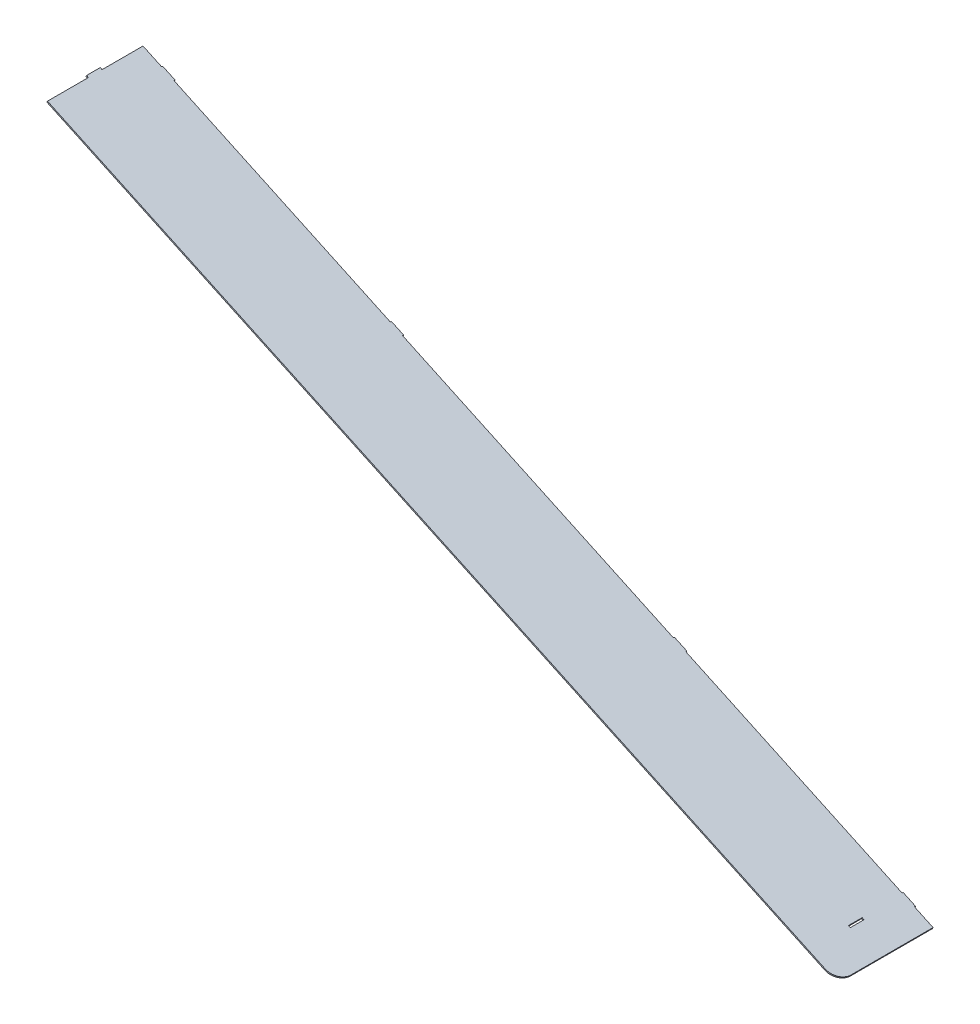
ISO-10303-21;
HEADER;
FILE_DESCRIPTION(('STEP AP214'),'2;1');
FILE_NAME('part.step','',(''),(''),'','','');
FILE_SCHEMA(('AUTOMOTIVE_DESIGN { 1 0 10303 214 1 1 1 1 }'));
ENDSEC;
DATA;
#1=APPLICATION_CONTEXT('core data for automotive mechanical design processes');
#2=APPLICATION_PROTOCOL_DEFINITION('international standard','automotive_design',2000,#1);
#3=PRODUCT_CONTEXT('',#1,'mechanical');
#4=PRODUCT('Part','Part','',(#3));
#5=PRODUCT_RELATED_PRODUCT_CATEGORY('part','',(#4));
#6=PRODUCT_DEFINITION_FORMATION('','',#4);
#7=PRODUCT_DEFINITION_CONTEXT('part definition',#1,'design');
#8=PRODUCT_DEFINITION('design','',#6,#7);
#9=PRODUCT_DEFINITION_SHAPE('','',#8);
#10=(LENGTH_UNIT() NAMED_UNIT(*) SI_UNIT(.MILLI.,.METRE.));
#11=(NAMED_UNIT(*) PLANE_ANGLE_UNIT() SI_UNIT($,.RADIAN.));
#12=(NAMED_UNIT(*) SI_UNIT($,.STERADIAN.) SOLID_ANGLE_UNIT());
#13=UNCERTAINTY_MEASURE_WITH_UNIT(LENGTH_MEASURE(1.E-05),#10,'distance_accuracy_value','');
#14=(GEOMETRIC_REPRESENTATION_CONTEXT(3) GLOBAL_UNCERTAINTY_ASSIGNED_CONTEXT((#13)) GLOBAL_UNIT_ASSIGNED_CONTEXT((#10,
#11,#12)) REPRESENTATION_CONTEXT('',''));
#15=CARTESIAN_POINT('',(0.,0.,0.));
#16=DIRECTION('',(0.,0.,1.));
#17=DIRECTION('',(1.,0.,0.));
#18=AXIS2_PLACEMENT_3D('',#15,#16,#17);
#19=CARTESIAN_POINT('',(2.22044604925031E-13,612.726283004898,142.));
#20=DIRECTION('',(-0.90630778703665,0.422618261740698,0.));
#21=DIRECTION('',(-0.422618261740699,-0.906307787036651,0.));
#22=AXIS2_PLACEMENT_3D('',#19,#20,#21);
#23=PLANE('',#22);
#24=DIRECTION('',(0.,0.,-1.));
#25=VECTOR('',#24,1.);
#26=CARTESIAN_POINT('',(2.22044604925031E-13,612.726283004898,142.));
#27=LINE('',#26,#25);
#28=CARTESIAN_POINT('',(2.22044604925031E-13,612.726283004898,62.));
#29=VERTEX_POINT('',#28);
#30=CARTESIAN_POINT('',(2.22044604925031E-13,612.726283004898,2.));
#31=VERTEX_POINT('',#30);
#32=EDGE_CURVE('E409',#29,#31,#27,.T.);
#33=ORIENTED_EDGE('',*,*,#32,.F.);
#34=DIRECTION('',(0.422618261740699,0.90630778703665,0.));
#35=VECTOR('',#34,1.);
#36=CARTESIAN_POINT('',(2.22044604925031E-13,612.726283004898,62.));
#37=LINE('',#36,#35);
#38=CARTESIAN_POINT('',(0.845236523481674,614.538898578972,62.));
#39=VERTEX_POINT('',#38);
#40=EDGE_CURVE('E272',#29,#39,#37,.T.);
#41=ORIENTED_EDGE('',*,*,#40,.T.);
#42=DIRECTION('',(0.,0.,-1.));
#43=VECTOR('',#42,1.);
#44=CARTESIAN_POINT('',(0.845236523481674,614.538898578972,142.));
#45=LINE('',#44,#43);
#46=CARTESIAN_POINT('',(0.845236523481674,614.538898578972,2.));
#47=VERTEX_POINT('',#46);
#48=EDGE_CURVE('E427',#39,#47,#45,.T.);
#49=ORIENTED_EDGE('',*,*,#48,.T.);
#50=DIRECTION('',(0.422618261740698,0.90630778703665,0.));
#51=VECTOR('',#50,1.);
#52=CARTESIAN_POINT('',(2.22044604925031E-13,612.726283004898,2.));
#53=LINE('',#52,#51);
#54=EDGE_CURVE('E403',#31,#47,#53,.T.);
#55=ORIENTED_EDGE('',*,*,#54,.F.);
#56=EDGE_LOOP('',(#33,#41,#49,#55));
#57=FACE_BOUND('',#56,.T.);
#58=ADVANCED_FACE('F36',(#57),#23,.T.);
#59=CARTESIAN_POINT('',(0.,0.,2.));
#60=DIRECTION('',(0.,0.,-1.));
#61=DIRECTION('',(-1.,0.,0.));
#62=AXIS2_PLACEMENT_3D('',#59,#60,#61);
#63=PLANE('',#62);
#64=DIRECTION('',(0.422618261740699,0.90630778703665,0.));
#65=VECTOR('',#64,1.);
#66=CARTESIAN_POINT('',(1112.83937412469,93.8007605541419,2.));
#67=LINE('',#66,#65);
#68=CARTESIAN_POINT('',(1112.83937412469,93.8007605541415,2.));
#69=VERTEX_POINT('',#68);
#70=CARTESIAN_POINT('',(1113.68461064817,95.6133761282152,2.));
#71=VERTEX_POINT('',#70);
#72=EDGE_CURVE('E299',#69,#71,#67,.T.);
#73=ORIENTED_EDGE('',*,*,#72,.F.);
#74=DIRECTION('',(0.90630778703665,-0.4226182617407,0.));
#75=VECTOR('',#74,1.);
#76=CARTESIAN_POINT('',(2.22044604925031E-13,612.726283004898,2.));
#77=LINE('',#76,#75);
#78=CARTESIAN_POINT('',(795.631648661858,241.717152163387,2.));
#79=VERTEX_POINT('',#78);
#80=EDGE_CURVE('E461',#79,#69,#77,.T.);
#81=ORIENTED_EDGE('',*,*,#80,.F.);
#82=DIRECTION('',(0.422618261740699,0.90630778703665,0.));
#83=VECTOR('',#82,1.);
#84=CARTESIAN_POINT('',(795.631648661858,241.717152163387,2.));
#85=LINE('',#84,#83);
#86=CARTESIAN_POINT('',(796.47688518534,243.52976773746,2.));
#87=VERTEX_POINT('',#86);
#88=EDGE_CURVE('E340',#79,#87,#85,.T.);
#89=ORIENTED_EDGE('',*,*,#88,.T.);
#90=DIRECTION('',(0.90630778703665,-0.4226182617407,0.));
#91=VECTOR('',#90,1.);
#92=CARTESIAN_POINT('',(0.845236523481674,614.538898578972,2.));
#93=LINE('',#92,#91);
#94=EDGE_CURVE('E502',#87,#71,#93,.T.);
#95=ORIENTED_EDGE('',*,*,#94,.T.);
#96=EDGE_LOOP('',(#73,#81,#89,#95));
#97=FACE_BOUND('',#96,.T.);
#98=ADVANCED_FACE('F501',(#97),#63,.T.);
#99=DIRECTION('',(0.422618261740699,0.90630778703665,0.));
#100=VECTOR('',#99,1.);
#101=CARTESIAN_POINT('',(777.505492921125,250.169517398201,2.));
#102=LINE('',#101,#100);
#103=CARTESIAN_POINT('',(777.505492921125,250.169517398201,2.));
#104=VERTEX_POINT('',#103);
#105=CARTESIAN_POINT('',(778.350729444607,251.982132972274,2.));
#106=VERTEX_POINT('',#105);
#107=EDGE_CURVE('E327',#104,#106,#102,.T.);
#108=ORIENTED_EDGE('',*,*,#107,.F.);
#109=CARTESIAN_POINT('',(380.649270555393,435.226613073805,2.));
#110=VERTEX_POINT('',#109);
#111=EDGE_CURVE('E463',#110,#104,#77,.T.);
#112=ORIENTED_EDGE('',*,*,#111,.F.);
#113=DIRECTION('',(0.422618261740699,0.90630778703665,0.));
#114=VECTOR('',#113,1.);
#115=CARTESIAN_POINT('',(380.649270555393,435.226613073805,2.));
#116=LINE('',#115,#114);
#117=CARTESIAN_POINT('',(381.494507078875,437.039228647878,2.));
#118=VERTEX_POINT('',#117);
#119=EDGE_CURVE('E368',#110,#118,#116,.T.);
#120=ORIENTED_EDGE('',*,*,#119,.T.);
#121=EDGE_CURVE('E488',#118,#106,#93,.T.);
#122=ORIENTED_EDGE('',*,*,#121,.T.);
#123=EDGE_LOOP('',(#108,#112,#120,#122));
#124=FACE_BOUND('',#123,.T.);
#125=ADVANCED_FACE('F487',(#124),#63,.T.);
#126=DIRECTION('',(0.422618261740699,0.90630778703665,0.));
#127=VECTOR('',#126,1.);
#128=CARTESIAN_POINT('',(362.52311481466,443.678978308619,2.));
#129=LINE('',#128,#127);
#130=CARTESIAN_POINT('',(362.52311481466,443.678978308619,2.));
#131=VERTEX_POINT('',#130);
#132=CARTESIAN_POINT('',(363.368351338141,445.491593882692,2.));
#133=VERTEX_POINT('',#132);
#134=EDGE_CURVE('E355',#131,#133,#129,.T.);
#135=ORIENTED_EDGE('',*,*,#134,.F.);
#136=CARTESIAN_POINT('',(45.3153893518327,591.595369917863,2.));
#137=VERTEX_POINT('',#136);
#138=EDGE_CURVE('E414',#137,#131,#77,.T.);
#139=ORIENTED_EDGE('',*,*,#138,.F.);
#140=DIRECTION('',(0.422618261740699,0.90630778703665,0.));
#141=VECTOR('',#140,1.);
#142=CARTESIAN_POINT('',(45.3153893518327,591.595369917863,2.));
#143=LINE('',#142,#141);
#144=CARTESIAN_POINT('',(46.1606258753141,593.407985491937,2.));
#145=VERTEX_POINT('',#144);
#146=EDGE_CURVE('E395',#137,#145,#143,.T.);
#147=ORIENTED_EDGE('',*,*,#146,.T.);
#148=EDGE_CURVE('E421',#145,#133,#93,.T.);
#149=ORIENTED_EDGE('',*,*,#148,.T.);
#150=EDGE_LOOP('',(#135,#139,#147,#149));
#151=FACE_BOUND('',#150,.T.);
#152=ADVANCED_FACE('F514',(#151),#63,.T.);
#153=DIRECTION('',(0.422618261740699,0.90630778703665,0.));
#154=VECTOR('',#153,1.);
#155=CARTESIAN_POINT('',(1130.96552986542,85.3483953193279,2.));
#156=LINE('',#155,#154);
#157=CARTESIAN_POINT('',(1130.96552986542,85.3483953193278,2.));
#158=VERTEX_POINT('',#157);
#159=CARTESIAN_POINT('',(1131.8107663889,87.1610108934012,2.));
#160=VERTEX_POINT('',#159);
#161=EDGE_CURVE('E312',#158,#160,#156,.T.);
#162=ORIENTED_EDGE('',*,*,#161,.T.);
#163=CARTESIAN_POINT('',(1159.,74.48246304118,2.));
#164=VERTEX_POINT('',#163);
#165=EDGE_CURVE('E417',#160,#164,#93,.T.);
#166=ORIENTED_EDGE('',*,*,#165,.T.);
#167=DIRECTION('',(-0.42261826174072,-0.90630778703664,0.));
#168=VECTOR('',#167,1.);
#169=CARTESIAN_POINT('',(1159.,74.48246304118,2.));
#170=LINE('',#169,#168);
#171=CARTESIAN_POINT('',(1158.15476347652,72.6698474671067,2.));
#172=VERTEX_POINT('',#171);
#173=EDGE_CURVE('E413',#164,#172,#170,.T.);
#174=ORIENTED_EDGE('',*,*,#173,.T.);
#175=EDGE_CURVE('E392',#158,#172,#77,.T.);
#176=ORIENTED_EDGE('',*,*,#175,.F.);
#177=EDGE_LOOP('',(#162,#166,#174,#176));
#178=FACE_BOUND('',#177,.T.);
#179=ADVANCED_FACE('F512',(#178),#63,.T.);
#180=CARTESIAN_POINT('',(2.22044604925031E-13,612.726283004898,142.));
#181=DIRECTION('',(0.4226182617407,0.90630778703665,0.));
#182=DIRECTION('',(-0.90630778703665,0.4226182617407,0.));
#183=AXIS2_PLACEMENT_3D('',#180,#181,#182);
#184=PLANE('',#183);
#185=DIRECTION('',(0.906307787036651,-0.422618261740698,0.));
#186=VECTOR('',#185,1.);
#187=CARTESIAN_POINT('',(1116.84573741881,91.932562668742,82.1));
#188=LINE('',#187,#186);
#189=CARTESIAN_POINT('',(1114.1268140577,93.2004174539641,82.1));
#190=VERTEX_POINT('',#189);
#191=CARTESIAN_POINT('',(1116.84573741881,91.932562668742,82.1));
#192=VERTEX_POINT('',#191);
#193=EDGE_CURVE('E234',#190,#192,#188,.T.);
#194=ORIENTED_EDGE('',*,*,#193,.T.);
#195=DIRECTION('',(0.,0.,-1.));
#196=VECTOR('',#195,1.);
#197=CARTESIAN_POINT('',(1116.84573741881,91.932562668742,61.9));
#198=LINE('',#197,#196);
#199=CARTESIAN_POINT('',(1116.84573741881,91.932562668742,61.9));
#200=VERTEX_POINT('',#199);
#201=EDGE_CURVE('E228',#192,#200,#198,.T.);
#202=ORIENTED_EDGE('',*,*,#201,.T.);
#203=DIRECTION('',(-0.906307787036651,0.422618261740698,0.));
#204=VECTOR('',#203,1.);
#205=CARTESIAN_POINT('',(1116.84573741881,91.932562668742,61.9));
#206=LINE('',#205,#204);
#207=CARTESIAN_POINT('',(1114.1268140577,93.2004174539638,61.9));
#208=VERTEX_POINT('',#207);
#209=EDGE_CURVE('E237',#200,#208,#206,.T.);
#210=ORIENTED_EDGE('',*,*,#209,.T.);
#211=DIRECTION('',(0.,0.,1.));
#212=VECTOR('',#211,1.);
#213=CARTESIAN_POINT('',(1114.1268140577,93.2004174539641,61.9));
#214=LINE('',#213,#212);
#215=EDGE_CURVE('E51',#208,#190,#214,.T.);
#216=ORIENTED_EDGE('',*,*,#215,.T.);
#217=EDGE_LOOP('',(#194,#202,#210,#216));
#218=FACE_BOUND('',#217,.T.);
#219=DIRECTION('',(0.,0.,-1.));
#220=VECTOR('',#219,1.);
#221=CARTESIAN_POINT('',(1158.15476347652,72.6698474671067,142.));
#222=LINE('',#221,#220);
#223=CARTESIAN_POINT('',(1158.15476347652,72.6698474671067,122.));
#224=VERTEX_POINT('',#223);
#225=EDGE_CURVE('E434',#224,#172,#222,.T.);
#226=ORIENTED_EDGE('',*,*,#225,.F.);
#227=CARTESIAN_POINT('',(1140.02860773579,81.1222127019207,122.));
#228=DIRECTION('',(0.4226182617407,0.90630778703665,0.));
#229=DIRECTION('',(-0.90630778703665,0.4226182617407,0.));
#230=AXIS2_PLACEMENT_3D('',#227,#228,#229);
#231=CIRCLE('',#230,20.);
#232=CARTESIAN_POINT('',(1140.02860773579,81.1222127019207,142.));
#233=VERTEX_POINT('',#232);
#234=EDGE_CURVE('E440',#224,#233,#231,.F.);
#235=ORIENTED_EDGE('',*,*,#234,.T.);
#236=DIRECTION('',(0.90630778703665,-0.4226182617407,0.));
#237=VECTOR('',#236,1.);
#238=CARTESIAN_POINT('',(2.22044604925031E-13,612.726283004898,142.));
#239=LINE('',#238,#237);
#240=CARTESIAN_POINT('',(2.22044604925031E-13,612.726283004898,142.));
#241=VERTEX_POINT('',#240);
#242=EDGE_CURVE('E399',#241,#233,#239,.T.);
#243=ORIENTED_EDGE('',*,*,#242,.F.);
#244=CARTESIAN_POINT('',(2.22044604925031E-13,612.726283004898,82.));
#245=VERTEX_POINT('',#244);
#246=EDGE_CURVE('E424',#241,#245,#27,.T.);
#247=ORIENTED_EDGE('',*,*,#246,.T.);
#248=DIRECTION('',(0.906307787036653,-0.422618261740693,0.));
#249=VECTOR('',#248,1.);
#250=CARTESIAN_POINT('',(2.22044604925031E-13,612.726283004898,82.));
#251=LINE('',#250,#249);
#252=CARTESIAN_POINT('',(-2.71892336110968,613.99413779012,82.));
#253=VERTEX_POINT('',#252);
#254=EDGE_CURVE('E270',#253,#245,#251,.T.);
#255=ORIENTED_EDGE('',*,*,#254,.F.);
#256=DIRECTION('',(0.,0.,1.));
#257=VECTOR('',#256,1.);
#258=CARTESIAN_POINT('',(-2.71892336110968,613.99413779012,82.));
#259=LINE('',#258,#257);
#260=CARTESIAN_POINT('',(-2.71892336110968,613.99413779012,62.));
#261=VERTEX_POINT('',#260);
#262=EDGE_CURVE('E266',#261,#253,#259,.T.);
#263=ORIENTED_EDGE('',*,*,#262,.F.);
#264=DIRECTION('',(-0.906307787036653,0.422618261740693,0.));
#265=VECTOR('',#264,1.);
#266=CARTESIAN_POINT('',(2.22044604925031E-13,612.726283004898,62.));
#267=LINE('',#266,#265);
#268=EDGE_CURVE('E263',#29,#261,#267,.T.);
#269=ORIENTED_EDGE('',*,*,#268,.F.);
#270=ORIENTED_EDGE('',*,*,#32,.T.);
#271=CARTESIAN_POINT('',(27.1892336110997,600.047735152677,2.));
#272=VERTEX_POINT('',#271);
#273=EDGE_CURVE('E410',#31,#272,#77,.T.);
#274=ORIENTED_EDGE('',*,*,#273,.T.);
#275=DIRECTION('',(0.,0.,1.));
#276=VECTOR('',#275,1.);
#277=CARTESIAN_POINT('',(27.1892336110997,600.047735152677,2.));
#278=LINE('',#277,#276);
#279=CARTESIAN_POINT('',(27.1892336110997,600.047735152677,0.5));
#280=VERTEX_POINT('',#279);
#281=EDGE_CURVE('E373',#280,#272,#278,.T.);
#282=ORIENTED_EDGE('',*,*,#281,.F.);
#283=DIRECTION('',(-0.90630778703665,0.422618261740698,0.));
#284=VECTOR('',#283,1.);
#285=CARTESIAN_POINT('',(27.1892336110997,600.047735152677,0.5));
#286=LINE('',#285,#284);
#287=CARTESIAN_POINT('',(45.3153893518327,591.595369917863,0.5));
#288=VERTEX_POINT('',#287);
#289=EDGE_CURVE('E379',#288,#280,#286,.T.);
#290=ORIENTED_EDGE('',*,*,#289,.F.);
#291=DIRECTION('',(0.,0.,-1.));
#292=VECTOR('',#291,1.);
#293=CARTESIAN_POINT('',(45.3153893518327,591.595369917863,2.));
#294=LINE('',#293,#292);
#295=EDGE_CURVE('E375',#137,#288,#294,.T.);
#296=ORIENTED_EDGE('',*,*,#295,.F.);
#297=ORIENTED_EDGE('',*,*,#138,.T.);
#298=DIRECTION('',(0.,0.,1.));
#299=VECTOR('',#298,1.);
#300=CARTESIAN_POINT('',(362.52311481466,443.678978308619,2.));
#301=LINE('',#300,#299);
#302=CARTESIAN_POINT('',(362.52311481466,443.678978308619,0.5));
#303=VERTEX_POINT('',#302);
#304=EDGE_CURVE('E345',#303,#131,#301,.T.);
#305=ORIENTED_EDGE('',*,*,#304,.F.);
#306=DIRECTION('',(-0.90630778703665,0.422618261740699,0.));
#307=VECTOR('',#306,1.);
#308=CARTESIAN_POINT('',(362.52311481466,443.678978308619,0.5));
#309=LINE('',#308,#307);
#310=CARTESIAN_POINT('',(380.649270555393,435.226613073805,0.5));
#311=VERTEX_POINT('',#310);
#312=EDGE_CURVE('E352',#311,#303,#309,.T.);
#313=ORIENTED_EDGE('',*,*,#312,.F.);
#314=DIRECTION('',(0.,0.,-1.));
#315=VECTOR('',#314,1.);
#316=CARTESIAN_POINT('',(380.649270555393,435.226613073805,2.));
#317=LINE('',#316,#315);
#318=EDGE_CURVE('E348',#110,#311,#317,.T.);
#319=ORIENTED_EDGE('',*,*,#318,.F.);
#320=ORIENTED_EDGE('',*,*,#111,.T.);
#321=DIRECTION('',(0.,0.,1.));
#322=VECTOR('',#321,1.);
#323=CARTESIAN_POINT('',(777.505492921125,250.169517398201,2.));
#324=LINE('',#323,#322);
#325=CARTESIAN_POINT('',(777.505492921125,250.169517398201,0.5));
#326=VERTEX_POINT('',#325);
#327=EDGE_CURVE('E317',#326,#104,#324,.T.);
#328=ORIENTED_EDGE('',*,*,#327,.F.);
#329=DIRECTION('',(-0.906307787036651,0.422618261740697,0.));
#330=VECTOR('',#329,1.);
#331=CARTESIAN_POINT('',(777.505492921125,250.169517398201,0.5));
#332=LINE('',#331,#330);
#333=CARTESIAN_POINT('',(795.631648661858,241.717152163387,0.5));
#334=VERTEX_POINT('',#333);
#335=EDGE_CURVE('E324',#334,#326,#332,.T.);
#336=ORIENTED_EDGE('',*,*,#335,.F.);
#337=DIRECTION('',(0.,0.,-1.));
#338=VECTOR('',#337,1.);
#339=CARTESIAN_POINT('',(795.631648661858,241.717152163387,2.));
#340=LINE('',#339,#338);
#341=EDGE_CURVE('E320',#79,#334,#340,.T.);
#342=ORIENTED_EDGE('',*,*,#341,.F.);
#343=ORIENTED_EDGE('',*,*,#80,.T.);
#344=DIRECTION('',(0.,0.,1.));
#345=VECTOR('',#344,1.);
#346=CARTESIAN_POINT('',(1112.83937412469,93.8007605541419,2.));
#347=LINE('',#346,#345);
#348=CARTESIAN_POINT('',(1112.83937412469,93.8007605541419,0.5));
#349=VERTEX_POINT('',#348);
#350=EDGE_CURVE('E289',#349,#69,#347,.T.);
#351=ORIENTED_EDGE('',*,*,#350,.F.);
#352=DIRECTION('',(-0.906307787036648,0.422618261740704,0.));
#353=VECTOR('',#352,1.);
#354=CARTESIAN_POINT('',(1112.83937412469,93.8007605541419,0.5));
#355=LINE('',#354,#353);
#356=CARTESIAN_POINT('',(1130.96552986542,85.3483953193279,0.5));
#357=VERTEX_POINT('',#356);
#358=EDGE_CURVE('E296',#357,#349,#355,.T.);
#359=ORIENTED_EDGE('',*,*,#358,.F.);
#360=DIRECTION('',(0.,0.,-1.));
#361=VECTOR('',#360,1.);
#362=CARTESIAN_POINT('',(1130.96552986542,85.3483953193279,2.));
#363=LINE('',#362,#361);
#364=EDGE_CURVE('E292',#158,#357,#363,.T.);
#365=ORIENTED_EDGE('',*,*,#364,.F.);
#366=ORIENTED_EDGE('',*,*,#175,.T.);
#367=EDGE_LOOP('',(#226,#235,#243,#247,#255,#263,#269,#270,#274,#282,#290,#296,#297,#305,#313,
#319,#320,#328,#336,#342,#343,#351,#359,#365,#366));
#368=FACE_BOUND('',#367,.T.);
#369=ADVANCED_FACE('F241',(#218,#368),#184,.F.);
#370=CARTESIAN_POINT('',(1159.,74.48246304118,142.));
#371=DIRECTION('',(0.90630778703664,-0.42261826174072,0.));
#372=DIRECTION('',(0.42261826174072,0.90630778703664,0.));
#373=AXIS2_PLACEMENT_3D('',#370,#371,#372);
#374=PLANE('',#373);
#375=DIRECTION('',(0.,0.,-1.));
#376=VECTOR('',#375,1.);
#377=CARTESIAN_POINT('',(1159.,74.48246304118,142.));
#378=LINE('',#377,#376);
#379=CARTESIAN_POINT('',(1159.,74.48246304118,122.));
#380=VERTEX_POINT('',#379);
#381=EDGE_CURVE('E431',#380,#164,#378,.T.);
#382=ORIENTED_EDGE('',*,*,#381,.F.);
#383=DIRECTION('',(-0.42261826174072,-0.90630778703664,0.));
#384=VECTOR('',#383,1.);
#385=CARTESIAN_POINT('',(1158.15476347652,72.6698474671067,122.));
#386=LINE('',#385,#384);
#387=EDGE_CURVE('E437',#380,#224,#386,.T.);
#388=ORIENTED_EDGE('',*,*,#387,.T.);
#389=ORIENTED_EDGE('',*,*,#225,.T.);
#390=ORIENTED_EDGE('',*,*,#173,.F.);
#391=EDGE_LOOP('',(#382,#388,#389,#390));
#392=FACE_BOUND('',#391,.T.);
#393=ADVANCED_FACE('F455',(#392),#374,.T.);
#394=CARTESIAN_POINT('',(0.845236523481674,614.538898578972,142.));
#395=DIRECTION('',(0.4226182617407,0.90630778703665,0.));
#396=DIRECTION('',(-0.90630778703665,0.4226182617407,0.));
#397=AXIS2_PLACEMENT_3D('',#394,#395,#396);
#398=PLANE('',#397);
#399=DIRECTION('',(0.,0.,-1.));
#400=VECTOR('',#399,1.);
#401=CARTESIAN_POINT('',(1117.69097394229,93.7451782428153,61.9));
#402=LINE('',#401,#400);
#403=CARTESIAN_POINT('',(1117.69097394229,93.7451782428153,82.1));
#404=VERTEX_POINT('',#403);
#405=CARTESIAN_POINT('',(1117.69097394229,93.7451782428151,61.9));
#406=VERTEX_POINT('',#405);
#407=EDGE_CURVE('E59',#404,#406,#402,.T.);
#408=ORIENTED_EDGE('',*,*,#407,.F.);
#409=DIRECTION('',(0.906307787036651,-0.422618261740698,0.));
#410=VECTOR('',#409,1.);
#411=CARTESIAN_POINT('',(1117.69097394229,93.7451782428153,82.1));
#412=LINE('',#411,#410);
#413=CARTESIAN_POINT('',(1114.97205058118,95.0130330280374,82.1));
#414=VERTEX_POINT('',#413);
#415=EDGE_CURVE('E244',#414,#404,#412,.T.);
#416=ORIENTED_EDGE('',*,*,#415,.F.);
#417=DIRECTION('',(0.,0.,1.));
#418=VECTOR('',#417,1.);
#419=CARTESIAN_POINT('',(1114.97205058118,95.0130330280374,61.9));
#420=LINE('',#419,#418);
#421=CARTESIAN_POINT('',(1114.97205058118,95.0130330280374,61.9));
#422=VERTEX_POINT('',#421);
#423=EDGE_CURVE('E247',#422,#414,#420,.T.);
#424=ORIENTED_EDGE('',*,*,#423,.F.);
#425=DIRECTION('',(-0.906307787036651,0.422618261740698,0.));
#426=VECTOR('',#425,1.);
#427=CARTESIAN_POINT('',(1117.69097394229,93.7451782428153,61.9));
#428=LINE('',#427,#426);
#429=EDGE_CURVE('E253',#406,#422,#428,.T.);
#430=ORIENTED_EDGE('',*,*,#429,.F.);
#431=EDGE_LOOP('',(#408,#416,#424,#430));
#432=FACE_BOUND('',#431,.T.);
#433=DIRECTION('',(0.90630778703665,-0.4226182617407,0.));
#434=VECTOR('',#433,1.);
#435=CARTESIAN_POINT('',(0.845236523481674,614.538898578972,142.));
#436=LINE('',#435,#434);
#437=CARTESIAN_POINT('',(0.845236523481674,614.538898578972,142.));
#438=VERTEX_POINT('',#437);
#439=CARTESIAN_POINT('',(1140.87384425927,82.934828275994,142.));
#440=VERTEX_POINT('',#439);
#441=EDGE_CURVE('E402',#438,#440,#436,.T.);
#442=ORIENTED_EDGE('',*,*,#441,.T.);
#443=CARTESIAN_POINT('',(1140.87384425927,82.934828275994,122.));
#444=DIRECTION('',(0.4226182617407,0.90630778703665,0.));
#445=DIRECTION('',(-0.90630778703665,0.4226182617407,0.));
#446=AXIS2_PLACEMENT_3D('',#443,#444,#445);
#447=CIRCLE('',#446,20.);
#448=EDGE_CURVE('E11',#440,#380,#447,.T.);
#449=ORIENTED_EDGE('',*,*,#448,.T.);
#450=ORIENTED_EDGE('',*,*,#381,.T.);
#451=ORIENTED_EDGE('',*,*,#165,.F.);
#452=DIRECTION('',(0.,0.,-1.));
#453=VECTOR('',#452,1.);
#454=CARTESIAN_POINT('',(1131.8107663889,87.1610108934012,2.));
#455=LINE('',#454,#453);
#456=CARTESIAN_POINT('',(1131.8107663889,87.1610108934012,0.5));
#457=VERTEX_POINT('',#456);
#458=EDGE_CURVE('E302',#160,#457,#455,.T.);
#459=ORIENTED_EDGE('',*,*,#458,.T.);
#460=DIRECTION('',(-0.906307787036648,0.422618261740704,0.));
#461=VECTOR('',#460,1.);
#462=CARTESIAN_POINT('',(1113.68461064817,95.6133761282153,0.5));
#463=LINE('',#462,#461);
#464=CARTESIAN_POINT('',(1113.68461064817,95.6133761282153,0.5));
#465=VERTEX_POINT('',#464);
#466=EDGE_CURVE('E293',#457,#465,#463,.T.);
#467=ORIENTED_EDGE('',*,*,#466,.T.);
#468=DIRECTION('',(0.,0.,1.));
#469=VECTOR('',#468,1.);
#470=CARTESIAN_POINT('',(1113.68461064817,95.6133761282153,2.));
#471=LINE('',#470,#469);
#472=EDGE_CURVE('E282',#465,#71,#471,.T.);
#473=ORIENTED_EDGE('',*,*,#472,.T.);
#474=ORIENTED_EDGE('',*,*,#94,.F.);
#475=DIRECTION('',(0.,0.,-1.));
#476=VECTOR('',#475,1.);
#477=CARTESIAN_POINT('',(796.47688518534,243.52976773746,2.));
#478=LINE('',#477,#476);
#479=CARTESIAN_POINT('',(796.47688518534,243.52976773746,0.5));
#480=VERTEX_POINT('',#479);
#481=EDGE_CURVE('E330',#87,#480,#478,.T.);
#482=ORIENTED_EDGE('',*,*,#481,.T.);
#483=DIRECTION('',(-0.906307787036651,0.422618261740697,0.));
#484=VECTOR('',#483,1.);
#485=CARTESIAN_POINT('',(778.350729444607,251.982132972274,0.5));
#486=LINE('',#485,#484);
#487=CARTESIAN_POINT('',(778.350729444607,251.982132972274,0.5));
#488=VERTEX_POINT('',#487);
#489=EDGE_CURVE('E321',#480,#488,#486,.T.);
#490=ORIENTED_EDGE('',*,*,#489,.T.);
#491=DIRECTION('',(0.,0.,1.));
#492=VECTOR('',#491,1.);
#493=CARTESIAN_POINT('',(778.350729444607,251.982132972274,2.));
#494=LINE('',#493,#492);
#495=EDGE_CURVE('E309',#488,#106,#494,.T.);
#496=ORIENTED_EDGE('',*,*,#495,.T.);
#497=ORIENTED_EDGE('',*,*,#121,.F.);
#498=DIRECTION('',(0.,0.,-1.));
#499=VECTOR('',#498,1.);
#500=CARTESIAN_POINT('',(381.494507078875,437.039228647878,2.));
#501=LINE('',#500,#499);
#502=CARTESIAN_POINT('',(381.494507078875,437.039228647878,0.5));
#503=VERTEX_POINT('',#502);
#504=EDGE_CURVE('E358',#118,#503,#501,.T.);
#505=ORIENTED_EDGE('',*,*,#504,.T.);
#506=DIRECTION('',(-0.90630778703665,0.422618261740699,0.));
#507=VECTOR('',#506,1.);
#508=CARTESIAN_POINT('',(363.368351338142,445.491593882692,0.5));
#509=LINE('',#508,#507);
#510=CARTESIAN_POINT('',(363.368351338142,445.491593882692,0.5));
#511=VERTEX_POINT('',#510);
#512=EDGE_CURVE('E349',#503,#511,#509,.T.);
#513=ORIENTED_EDGE('',*,*,#512,.T.);
#514=DIRECTION('',(0.,0.,1.));
#515=VECTOR('',#514,1.);
#516=CARTESIAN_POINT('',(363.368351338142,445.491593882692,2.));
#517=LINE('',#516,#515);
#518=EDGE_CURVE('E337',#511,#133,#517,.T.);
#519=ORIENTED_EDGE('',*,*,#518,.T.);
#520=ORIENTED_EDGE('',*,*,#148,.F.);
#521=DIRECTION('',(0.,0.,-1.));
#522=VECTOR('',#521,1.);
#523=CARTESIAN_POINT('',(46.1606258753141,593.407985491937,2.));
#524=LINE('',#523,#522);
#525=CARTESIAN_POINT('',(46.1606258753141,593.407985491937,0.5));
#526=VERTEX_POINT('',#525);
#527=EDGE_CURVE('E385',#145,#526,#524,.T.);
#528=ORIENTED_EDGE('',*,*,#527,.T.);
#529=DIRECTION('',(-0.90630778703665,0.422618261740698,0.));
#530=VECTOR('',#529,1.);
#531=CARTESIAN_POINT('',(28.034470134581,601.860350726751,0.5));
#532=LINE('',#531,#530);
#533=CARTESIAN_POINT('',(28.034470134581,601.860350726751,0.5));
#534=VERTEX_POINT('',#533);
#535=EDGE_CURVE('E376',#526,#534,#532,.T.);
#536=ORIENTED_EDGE('',*,*,#535,.T.);
#537=DIRECTION('',(0.,0.,1.));
#538=VECTOR('',#537,1.);
#539=CARTESIAN_POINT('',(28.034470134581,601.860350726751,2.));
#540=LINE('',#539,#538);
#541=CARTESIAN_POINT('',(28.034470134581,601.860350726751,2.));
#542=VERTEX_POINT('',#541);
#543=EDGE_CURVE('E365',#534,#542,#540,.T.);
#544=ORIENTED_EDGE('',*,*,#543,.T.);
#545=EDGE_CURVE('E418',#47,#542,#93,.T.);
#546=ORIENTED_EDGE('',*,*,#545,.F.);
#547=ORIENTED_EDGE('',*,*,#48,.F.);
#548=DIRECTION('',(-0.906307787036653,0.422618261740693,0.));
#549=VECTOR('',#548,1.);
#550=CARTESIAN_POINT('',(0.845236523481674,614.538898578972,62.));
#551=LINE('',#550,#549);
#552=CARTESIAN_POINT('',(-1.87368683762834,615.806753364194,62.));
#553=VERTEX_POINT('',#552);
#554=EDGE_CURVE('E259',#39,#553,#551,.T.);
#555=ORIENTED_EDGE('',*,*,#554,.T.);
#556=DIRECTION('',(0.,0.,1.));
#557=VECTOR('',#556,1.);
#558=CARTESIAN_POINT('',(-1.87368683762834,615.806753364194,82.));
#559=LINE('',#558,#557);
#560=CARTESIAN_POINT('',(-1.87368683762834,615.806753364194,82.));
#561=VERTEX_POINT('',#560);
#562=EDGE_CURVE('E275',#553,#561,#559,.T.);
#563=ORIENTED_EDGE('',*,*,#562,.T.);
#564=DIRECTION('',(0.906307787036653,-0.422618261740693,0.));
#565=VECTOR('',#564,1.);
#566=CARTESIAN_POINT('',(0.845236523481674,614.538898578972,82.));
#567=LINE('',#566,#565);
#568=CARTESIAN_POINT('',(0.845236523481674,614.538898578972,82.));
#569=VERTEX_POINT('',#568);
#570=EDGE_CURVE('E267',#561,#569,#567,.T.);
#571=ORIENTED_EDGE('',*,*,#570,.T.);
#572=EDGE_CURVE('E428',#438,#569,#45,.T.);
#573=ORIENTED_EDGE('',*,*,#572,.F.);
#574=EDGE_LOOP('',(#442,#449,#450,#451,#459,#467,#473,#474,#482,#490,#496,#497,#505,#513,#519,
#520,#528,#536,#544,#546,#547,#555,#563,#571,#573));
#575=FACE_BOUND('',#574,.T.);
#576=ADVANCED_FACE('F450',(#432,#575),#398,.T.);
#577=DIRECTION('',(0.422618261740699,0.90630778703665,0.));
#578=VECTOR('',#577,1.);
#579=CARTESIAN_POINT('',(2.22044604925031E-13,612.726283004898,82.));
#580=LINE('',#579,#578);
#581=EDGE_CURVE('E280',#245,#569,#580,.T.);
#582=ORIENTED_EDGE('',*,*,#581,.F.);
#583=ORIENTED_EDGE('',*,*,#246,.F.);
#584=DIRECTION('',(0.422618261740698,0.90630778703665,0.));
#585=VECTOR('',#584,1.);
#586=CARTESIAN_POINT('',(2.22044604925031E-13,612.726283004898,142.));
#587=LINE('',#586,#585);
#588=EDGE_CURVE('E406',#241,#438,#587,.T.);
#589=ORIENTED_EDGE('',*,*,#588,.T.);
#590=ORIENTED_EDGE('',*,*,#572,.T.);
#591=EDGE_LOOP('',(#582,#583,#589,#590));
#592=FACE_BOUND('',#591,.T.);
#593=ADVANCED_FACE('F545',(#592),#23,.T.);
#594=CARTESIAN_POINT('',(0.,0.,142.));
#595=DIRECTION('',(0.,0.,-1.));
#596=DIRECTION('',(-1.,0.,0.));
#597=AXIS2_PLACEMENT_3D('',#594,#595,#596);
#598=PLANE('',#597);
#599=ORIENTED_EDGE('',*,*,#242,.T.);
#600=DIRECTION('',(-0.42261826174072,-0.90630778703664,0.));
#601=VECTOR('',#600,1.);
#602=CARTESIAN_POINT('',(1140.87384425927,82.9348282759944,142.));
#603=LINE('',#602,#601);
#604=EDGE_CURVE('E44',#233,#440,#603,.F.);
#605=ORIENTED_EDGE('',*,*,#604,.T.);
#606=ORIENTED_EDGE('',*,*,#441,.F.);
#607=ORIENTED_EDGE('',*,*,#588,.F.);
#608=EDGE_LOOP('',(#599,#605,#606,#607));
#609=FACE_BOUND('',#608,.T.);
#610=ADVANCED_FACE('F444',(#609),#598,.F.);
#611=DIRECTION('',(0.422618261740699,0.90630778703665,0.));
#612=VECTOR('',#611,1.);
#613=CARTESIAN_POINT('',(27.1892336110997,600.047735152677,2.));
#614=LINE('',#613,#612);
#615=EDGE_CURVE('E382',#272,#542,#614,.T.);
#616=ORIENTED_EDGE('',*,*,#615,.F.);
#617=ORIENTED_EDGE('',*,*,#273,.F.);
#618=ORIENTED_EDGE('',*,*,#54,.T.);
#619=ORIENTED_EDGE('',*,*,#545,.T.);
#620=EDGE_LOOP('',(#616,#617,#618,#619));
#621=FACE_BOUND('',#620,.T.);
#622=ADVANCED_FACE('F527',(#621),#63,.T.);
#623=CARTESIAN_POINT('',(1140.87384425927,82.9348282759944,122.));
#624=DIRECTION('',(0.42261826174072,0.90630778703664,0.));
#625=DIRECTION('',(-0.90630778703664,0.42261826174072,0.));
#626=AXIS2_PLACEMENT_3D('',#623,#624,#625);
#627=CYLINDRICAL_SURFACE('',#626,20.);
#628=ORIENTED_EDGE('',*,*,#448,.F.);
#629=ORIENTED_EDGE('',*,*,#604,.F.);
#630=ORIENTED_EDGE('',*,*,#234,.F.);
#631=ORIENTED_EDGE('',*,*,#387,.F.);
#632=EDGE_LOOP('',(#628,#629,#630,#631));
#633=FACE_BOUND('',#632,.T.);
#634=ADVANCED_FACE('F38',(#633),#627,.T.);
#635=CARTESIAN_POINT('',(27.1892336110997,600.047735152677,2.));
#636=DIRECTION('',(-0.90630778703665,0.422618261740699,0.));
#637=DIRECTION('',(-0.422618261740699,-0.90630778703665,0.));
#638=AXIS2_PLACEMENT_3D('',#635,#636,#637);
#639=PLANE('',#638);
#640=ORIENTED_EDGE('',*,*,#543,.F.);
#641=DIRECTION('',(0.422618261740699,0.90630778703665,0.));
#642=VECTOR('',#641,1.);
#643=CARTESIAN_POINT('',(27.1892336110997,600.047735152677,0.5));
#644=LINE('',#643,#642);
#645=EDGE_CURVE('E390',#280,#534,#644,.T.);
#646=ORIENTED_EDGE('',*,*,#645,.F.);
#647=ORIENTED_EDGE('',*,*,#281,.T.);
#648=ORIENTED_EDGE('',*,*,#615,.T.);
#649=EDGE_LOOP('',(#640,#646,#647,#648));
#650=FACE_BOUND('',#649,.T.);
#651=ADVANCED_FACE('F522',(#650),#639,.T.);
#652=CARTESIAN_POINT('',(27.1892336110997,600.047735152677,0.5));
#653=DIRECTION('',(0.,0.,-1.));
#654=DIRECTION('',(-1.,0.,0.));
#655=AXIS2_PLACEMENT_3D('',#652,#653,#654);
#656=PLANE('',#655);
#657=ORIENTED_EDGE('',*,*,#535,.F.);
#658=DIRECTION('',(0.422618261740699,0.90630778703665,0.));
#659=VECTOR('',#658,1.);
#660=CARTESIAN_POINT('',(45.3153893518327,591.595369917863,0.5));
#661=LINE('',#660,#659);
#662=EDGE_CURVE('E393',#288,#526,#661,.T.);
#663=ORIENTED_EDGE('',*,*,#662,.F.);
#664=ORIENTED_EDGE('',*,*,#289,.T.);
#665=ORIENTED_EDGE('',*,*,#645,.T.);
#666=EDGE_LOOP('',(#657,#663,#664,#665));
#667=FACE_BOUND('',#666,.T.);
#668=ADVANCED_FACE('F518',(#667),#656,.T.);
#669=CARTESIAN_POINT('',(45.3153893518327,591.595369917863,2.));
#670=DIRECTION('',(0.90630778703665,-0.422618261740699,0.));
#671=DIRECTION('',(0.422618261740699,0.90630778703665,0.));
#672=AXIS2_PLACEMENT_3D('',#669,#670,#671);
#673=PLANE('',#672);
#674=ORIENTED_EDGE('',*,*,#527,.F.);
#675=ORIENTED_EDGE('',*,*,#146,.F.);
#676=ORIENTED_EDGE('',*,*,#295,.T.);
#677=ORIENTED_EDGE('',*,*,#662,.T.);
#678=EDGE_LOOP('',(#674,#675,#676,#677));
#679=FACE_BOUND('',#678,.T.);
#680=ADVANCED_FACE('F688',(#679),#673,.T.);
#681=CARTESIAN_POINT('',(362.52311481466,443.678978308619,2.));
#682=DIRECTION('',(-0.90630778703665,0.422618261740699,0.));
#683=DIRECTION('',(-0.422618261740699,-0.90630778703665,0.));
#684=AXIS2_PLACEMENT_3D('',#681,#682,#683);
#685=PLANE('',#684);
#686=ORIENTED_EDGE('',*,*,#518,.F.);
#687=DIRECTION('',(0.422618261740699,0.90630778703665,0.));
#688=VECTOR('',#687,1.);
#689=CARTESIAN_POINT('',(362.52311481466,443.678978308619,0.5));
#690=LINE('',#689,#688);
#691=EDGE_CURVE('E363',#303,#511,#690,.T.);
#692=ORIENTED_EDGE('',*,*,#691,.F.);
#693=ORIENTED_EDGE('',*,*,#304,.T.);
#694=ORIENTED_EDGE('',*,*,#134,.T.);
#695=EDGE_LOOP('',(#686,#692,#693,#694));
#696=FACE_BOUND('',#695,.T.);
#697=ADVANCED_FACE('F478',(#696),#685,.T.);
#698=CARTESIAN_POINT('',(362.52311481466,443.678978308619,0.5));
#699=DIRECTION('',(0.,0.,-1.));
#700=DIRECTION('',(-1.,0.,0.));
#701=AXIS2_PLACEMENT_3D('',#698,#699,#700);
#702=PLANE('',#701);
#703=ORIENTED_EDGE('',*,*,#512,.F.);
#704=DIRECTION('',(0.422618261740699,0.90630778703665,0.));
#705=VECTOR('',#704,1.);
#706=CARTESIAN_POINT('',(380.649270555393,435.226613073805,0.5));
#707=LINE('',#706,#705);
#708=EDGE_CURVE('E366',#311,#503,#707,.T.);
#709=ORIENTED_EDGE('',*,*,#708,.F.);
#710=ORIENTED_EDGE('',*,*,#312,.T.);
#711=ORIENTED_EDGE('',*,*,#691,.T.);
#712=EDGE_LOOP('',(#703,#709,#710,#711));
#713=FACE_BOUND('',#712,.T.);
#714=ADVANCED_FACE('F481',(#713),#702,.T.);
#715=CARTESIAN_POINT('',(380.649270555393,435.226613073805,2.));
#716=DIRECTION('',(0.90630778703665,-0.422618261740699,0.));
#717=DIRECTION('',(0.422618261740699,0.90630778703665,0.));
#718=AXIS2_PLACEMENT_3D('',#715,#716,#717);
#719=PLANE('',#718);
#720=ORIENTED_EDGE('',*,*,#504,.F.);
#721=ORIENTED_EDGE('',*,*,#119,.F.);
#722=ORIENTED_EDGE('',*,*,#318,.T.);
#723=ORIENTED_EDGE('',*,*,#708,.T.);
#724=EDGE_LOOP('',(#720,#721,#722,#723));
#725=FACE_BOUND('',#724,.T.);
#726=ADVANCED_FACE('F485',(#725),#719,.T.);
#727=CARTESIAN_POINT('',(777.505492921125,250.169517398201,2.));
#728=DIRECTION('',(-0.90630778703665,0.422618261740699,0.));
#729=DIRECTION('',(-0.422618261740699,-0.90630778703665,0.));
#730=AXIS2_PLACEMENT_3D('',#727,#728,#729);
#731=PLANE('',#730);
#732=ORIENTED_EDGE('',*,*,#495,.F.);
#733=DIRECTION('',(0.422618261740699,0.90630778703665,0.));
#734=VECTOR('',#733,1.);
#735=CARTESIAN_POINT('',(777.505492921125,250.169517398201,0.5));
#736=LINE('',#735,#734);
#737=EDGE_CURVE('E335',#326,#488,#736,.T.);
#738=ORIENTED_EDGE('',*,*,#737,.F.);
#739=ORIENTED_EDGE('',*,*,#327,.T.);
#740=ORIENTED_EDGE('',*,*,#107,.T.);
#741=EDGE_LOOP('',(#732,#738,#739,#740));
#742=FACE_BOUND('',#741,.T.);
#743=ADVANCED_FACE('F491',(#742),#731,.T.);
#744=CARTESIAN_POINT('',(777.505492921125,250.169517398201,0.5));
#745=DIRECTION('',(0.,0.,-1.));
#746=DIRECTION('',(-1.,0.,0.));
#747=AXIS2_PLACEMENT_3D('',#744,#745,#746);
#748=PLANE('',#747);
#749=ORIENTED_EDGE('',*,*,#489,.F.);
#750=DIRECTION('',(0.422618261740699,0.90630778703665,0.));
#751=VECTOR('',#750,1.);
#752=CARTESIAN_POINT('',(795.631648661858,241.717152163387,0.5));
#753=LINE('',#752,#751);
#754=EDGE_CURVE('E338',#334,#480,#753,.T.);
#755=ORIENTED_EDGE('',*,*,#754,.F.);
#756=ORIENTED_EDGE('',*,*,#335,.T.);
#757=ORIENTED_EDGE('',*,*,#737,.T.);
#758=EDGE_LOOP('',(#749,#755,#756,#757));
#759=FACE_BOUND('',#758,.T.);
#760=ADVANCED_FACE('F495',(#759),#748,.T.);
#761=CARTESIAN_POINT('',(795.631648661858,241.717152163387,2.));
#762=DIRECTION('',(0.90630778703665,-0.422618261740699,0.));
#763=DIRECTION('',(0.422618261740699,0.90630778703665,0.));
#764=AXIS2_PLACEMENT_3D('',#761,#762,#763);
#765=PLANE('',#764);
#766=ORIENTED_EDGE('',*,*,#481,.F.);
#767=ORIENTED_EDGE('',*,*,#88,.F.);
#768=ORIENTED_EDGE('',*,*,#341,.T.);
#769=ORIENTED_EDGE('',*,*,#754,.T.);
#770=EDGE_LOOP('',(#766,#767,#768,#769));
#771=FACE_BOUND('',#770,.T.);
#772=ADVANCED_FACE('F499',(#771),#765,.T.);
#773=CARTESIAN_POINT('',(1112.83937412469,93.8007605541419,2.));
#774=DIRECTION('',(-0.90630778703665,0.422618261740699,0.));
#775=DIRECTION('',(-0.422618261740699,-0.90630778703665,0.));
#776=AXIS2_PLACEMENT_3D('',#773,#774,#775);
#777=PLANE('',#776);
#778=ORIENTED_EDGE('',*,*,#472,.F.);
#779=DIRECTION('',(0.422618261740699,0.90630778703665,0.));
#780=VECTOR('',#779,1.);
#781=CARTESIAN_POINT('',(1112.83937412469,93.8007605541419,0.5));
#782=LINE('',#781,#780);
#783=EDGE_CURVE('E307',#349,#465,#782,.T.);
#784=ORIENTED_EDGE('',*,*,#783,.F.);
#785=ORIENTED_EDGE('',*,*,#350,.T.);
#786=ORIENTED_EDGE('',*,*,#72,.T.);
#787=EDGE_LOOP('',(#778,#784,#785,#786));
#788=FACE_BOUND('',#787,.T.);
#789=ADVANCED_FACE('F505',(#788),#777,.T.);
#790=CARTESIAN_POINT('',(1112.83937412469,93.8007605541419,0.5));
#791=DIRECTION('',(0.,0.,-1.));
#792=DIRECTION('',(-1.,0.,0.));
#793=AXIS2_PLACEMENT_3D('',#790,#791,#792);
#794=PLANE('',#793);
#795=ORIENTED_EDGE('',*,*,#466,.F.);
#796=DIRECTION('',(0.422618261740699,0.90630778703665,0.));
#797=VECTOR('',#796,1.);
#798=CARTESIAN_POINT('',(1130.96552986542,85.3483953193279,0.5));
#799=LINE('',#798,#797);
#800=EDGE_CURVE('E310',#357,#457,#799,.T.);
#801=ORIENTED_EDGE('',*,*,#800,.F.);
#802=ORIENTED_EDGE('',*,*,#358,.T.);
#803=ORIENTED_EDGE('',*,*,#783,.T.);
#804=EDGE_LOOP('',(#795,#801,#802,#803));
#805=FACE_BOUND('',#804,.T.);
#806=ADVANCED_FACE('F509',(#805),#794,.T.);
#807=CARTESIAN_POINT('',(1130.96552986542,85.3483953193279,2.));
#808=DIRECTION('',(0.90630778703665,-0.422618261740699,0.));
#809=DIRECTION('',(0.422618261740699,0.90630778703665,0.));
#810=AXIS2_PLACEMENT_3D('',#807,#808,#809);
#811=PLANE('',#810);
#812=ORIENTED_EDGE('',*,*,#458,.F.);
#813=ORIENTED_EDGE('',*,*,#161,.F.);
#814=ORIENTED_EDGE('',*,*,#364,.T.);
#815=ORIENTED_EDGE('',*,*,#800,.T.);
#816=EDGE_LOOP('',(#812,#813,#814,#815));
#817=FACE_BOUND('',#816,.T.);
#818=ADVANCED_FACE('F511',(#817),#811,.T.);
#819=CARTESIAN_POINT('',(2.22044604925031E-13,612.726283004898,82.));
#820=DIRECTION('',(0.,0.,1.));
#821=DIRECTION('',(1.,0.,0.));
#822=AXIS2_PLACEMENT_3D('',#819,#820,#821);
#823=PLANE('',#822);
#824=ORIENTED_EDGE('',*,*,#570,.F.);
#825=DIRECTION('',(0.422618261740699,0.90630778703665,0.));
#826=VECTOR('',#825,1.);
#827=CARTESIAN_POINT('',(-2.71892336110968,613.99413779012,82.));
#828=LINE('',#827,#826);
#829=EDGE_CURVE('E283',#253,#561,#828,.T.);
#830=ORIENTED_EDGE('',*,*,#829,.F.);
#831=ORIENTED_EDGE('',*,*,#254,.T.);
#832=ORIENTED_EDGE('',*,*,#581,.T.);
#833=EDGE_LOOP('',(#824,#830,#831,#832));
#834=FACE_BOUND('',#833,.T.);
#835=ADVANCED_FACE('F542',(#834),#823,.T.);
#836=CARTESIAN_POINT('',(-2.71892336110968,613.99413779012,82.));
#837=DIRECTION('',(-0.90630778703665,0.422618261740699,0.));
#838=DIRECTION('',(-0.422618261740699,-0.90630778703665,0.));
#839=AXIS2_PLACEMENT_3D('',#836,#837,#838);
#840=PLANE('',#839);
#841=ORIENTED_EDGE('',*,*,#562,.F.);
#842=DIRECTION('',(0.422618261740699,0.90630778703665,0.));
#843=VECTOR('',#842,1.);
#844=CARTESIAN_POINT('',(-2.71892336110968,613.99413779012,62.));
#845=LINE('',#844,#843);
#846=EDGE_CURVE('E285',#261,#553,#845,.T.);
#847=ORIENTED_EDGE('',*,*,#846,.F.);
#848=ORIENTED_EDGE('',*,*,#262,.T.);
#849=ORIENTED_EDGE('',*,*,#829,.T.);
#850=EDGE_LOOP('',(#841,#847,#848,#849));
#851=FACE_BOUND('',#850,.T.);
#852=ADVANCED_FACE('F539',(#851),#840,.T.);
#853=CARTESIAN_POINT('',(2.22044604925031E-13,612.726283004898,62.));
#854=DIRECTION('',(0.,0.,-1.));
#855=DIRECTION('',(-1.,0.,0.));
#856=AXIS2_PLACEMENT_3D('',#853,#854,#855);
#857=PLANE('',#856);
#858=ORIENTED_EDGE('',*,*,#554,.F.);
#859=ORIENTED_EDGE('',*,*,#40,.F.);
#860=ORIENTED_EDGE('',*,*,#268,.T.);
#861=ORIENTED_EDGE('',*,*,#846,.T.);
#862=EDGE_LOOP('',(#858,#859,#860,#861));
#863=FACE_BOUND('',#862,.T.);
#864=ADVANCED_FACE('F535',(#863),#857,.T.);
#865=CARTESIAN_POINT('',(1116.84573741881,91.932562668742,61.9));
#866=DIRECTION('',(0.90630778703665,-0.422618261740699,0.));
#867=DIRECTION('',(0.422618261740699,0.90630778703665,0.));
#868=AXIS2_PLACEMENT_3D('',#865,#866,#867);
#869=PLANE('',#868);
#870=ORIENTED_EDGE('',*,*,#407,.T.);
#871=DIRECTION('',(0.422618261740699,0.90630778703665,0.));
#872=VECTOR('',#871,1.);
#873=CARTESIAN_POINT('',(1116.84573741881,91.932562668742,61.9));
#874=LINE('',#873,#872);
#875=EDGE_CURVE('E224',#200,#406,#874,.T.);
#876=ORIENTED_EDGE('',*,*,#875,.F.);
#877=ORIENTED_EDGE('',*,*,#201,.F.);
#878=DIRECTION('',(0.422618261740699,0.90630778703665,0.));
#879=VECTOR('',#878,1.);
#880=CARTESIAN_POINT('',(1116.84573741881,91.932562668742,82.1));
#881=LINE('',#880,#879);
#882=EDGE_CURVE('E257',#192,#404,#881,.T.);
#883=ORIENTED_EDGE('',*,*,#882,.T.);
#884=EDGE_LOOP('',(#870,#876,#877,#883));
#885=FACE_BOUND('',#884,.T.);
#886=ADVANCED_FACE('F226',(#885),#869,.F.);
#887=CARTESIAN_POINT('',(1116.84573741881,91.932562668742,82.1));
#888=DIRECTION('',(0.,0.,1.));
#889=DIRECTION('',(1.,0.,0.));
#890=AXIS2_PLACEMENT_3D('',#887,#888,#889);
#891=PLANE('',#890);
#892=ORIENTED_EDGE('',*,*,#415,.T.);
#893=ORIENTED_EDGE('',*,*,#882,.F.);
#894=ORIENTED_EDGE('',*,*,#193,.F.);
#895=DIRECTION('',(0.422618261740699,0.90630778703665,0.));
#896=VECTOR('',#895,1.);
#897=CARTESIAN_POINT('',(1114.1268140577,93.2004174539641,82.1));
#898=LINE('',#897,#896);
#899=EDGE_CURVE('E260',#190,#414,#898,.T.);
#900=ORIENTED_EDGE('',*,*,#899,.T.);
#901=EDGE_LOOP('',(#892,#893,#894,#900));
#902=FACE_BOUND('',#901,.T.);
#903=ADVANCED_FACE('F815',(#902),#891,.F.);
#904=CARTESIAN_POINT('',(1114.1268140577,93.2004174539641,61.9));
#905=DIRECTION('',(-0.90630778703665,0.422618261740699,0.));
#906=DIRECTION('',(-0.422618261740699,-0.90630778703665,0.));
#907=AXIS2_PLACEMENT_3D('',#904,#905,#906);
#908=PLANE('',#907);
#909=ORIENTED_EDGE('',*,*,#423,.T.);
#910=ORIENTED_EDGE('',*,*,#899,.F.);
#911=ORIENTED_EDGE('',*,*,#215,.F.);
#912=DIRECTION('',(0.422618261740699,0.90630778703665,0.));
#913=VECTOR('',#912,1.);
#914=CARTESIAN_POINT('',(1114.1268140577,93.2004174539641,61.9));
#915=LINE('',#914,#913);
#916=EDGE_CURVE('E233',#208,#422,#915,.T.);
#917=ORIENTED_EDGE('',*,*,#916,.T.);
#918=EDGE_LOOP('',(#909,#910,#911,#917));
#919=FACE_BOUND('',#918,.T.);
#920=ADVANCED_FACE('F824',(#919),#908,.F.);
#921=CARTESIAN_POINT('',(1116.84573741881,91.932562668742,61.9));
#922=DIRECTION('',(0.,0.,-1.));
#923=DIRECTION('',(-1.,0.,0.));
#924=AXIS2_PLACEMENT_3D('',#921,#922,#923);
#925=PLANE('',#924);
#926=ORIENTED_EDGE('',*,*,#429,.T.);
#927=ORIENTED_EDGE('',*,*,#916,.F.);
#928=ORIENTED_EDGE('',*,*,#209,.F.);
#929=ORIENTED_EDGE('',*,*,#875,.T.);
#930=EDGE_LOOP('',(#926,#927,#928,#929));
#931=FACE_BOUND('',#930,.T.);
#932=ADVANCED_FACE('F238',(#931),#925,.F.);
#933=CLOSED_SHELL('',(#58,#98,#125,#152,#179,#369,#393,#576,#593,#610,#622,#634,#651,#668,#680,
#697,#714,#726,#743,#760,#772,#789,#806,#818,#835,#852,#864,#886,#903,#920,#932));
#934=MANIFOLD_SOLID_BREP('B2',#933);
#935=ADVANCED_BREP_SHAPE_REPRESENTATION('',(#18,#934),#14);
#936=SHAPE_DEFINITION_REPRESENTATION(#9,#935);
ENDSEC;
END-ISO-10303-21;
